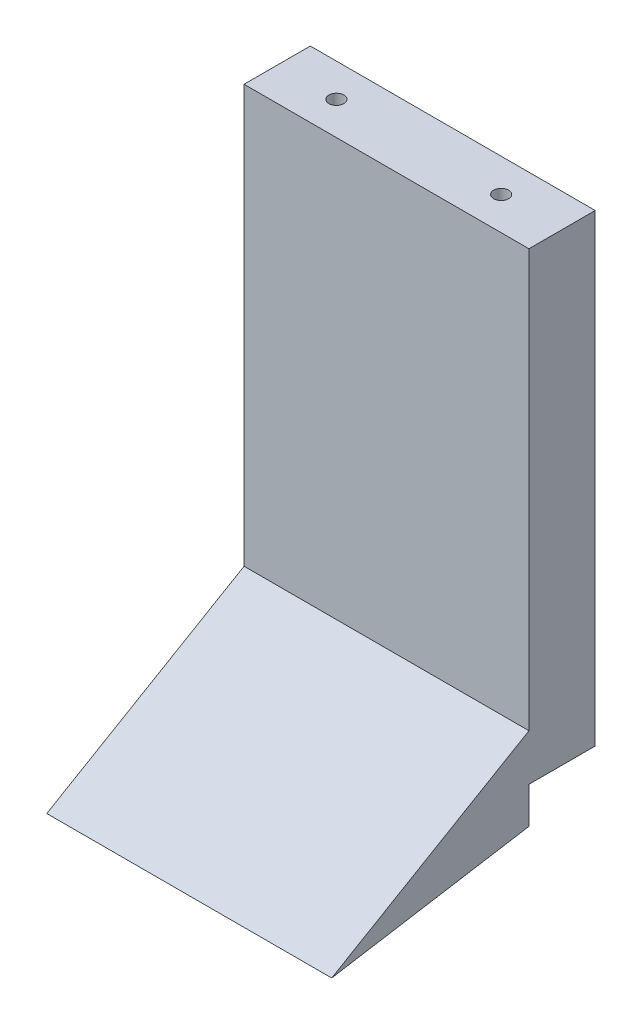
ISO-10303-21;
HEADER;
FILE_DESCRIPTION(('STEP AP214'),'2;1');
FILE_NAME('part.step','',(''),(''),'','','');
FILE_SCHEMA(('AUTOMOTIVE_DESIGN { 1 0 10303 214 1 1 1 1 }'));
ENDSEC;
DATA;
#1=APPLICATION_CONTEXT('core data for automotive mechanical design processes');
#2=APPLICATION_PROTOCOL_DEFINITION('international standard','automotive_design',2000,#1);
#3=PRODUCT_CONTEXT('',#1,'mechanical');
#4=PRODUCT('Part','Part','',(#3));
#5=PRODUCT_RELATED_PRODUCT_CATEGORY('part','',(#4));
#6=PRODUCT_DEFINITION_FORMATION('','',#4);
#7=PRODUCT_DEFINITION_CONTEXT('part definition',#1,'design');
#8=PRODUCT_DEFINITION('design','',#6,#7);
#9=PRODUCT_DEFINITION_SHAPE('','',#8);
#10=(LENGTH_UNIT() NAMED_UNIT(*) SI_UNIT(.MILLI.,.METRE.));
#11=(NAMED_UNIT(*) PLANE_ANGLE_UNIT() SI_UNIT($,.RADIAN.));
#12=(NAMED_UNIT(*) SI_UNIT($,.STERADIAN.) SOLID_ANGLE_UNIT());
#13=UNCERTAINTY_MEASURE_WITH_UNIT(LENGTH_MEASURE(1.E-05),#10,'distance_accuracy_value','');
#14=(GEOMETRIC_REPRESENTATION_CONTEXT(3) GLOBAL_UNCERTAINTY_ASSIGNED_CONTEXT((#13)) GLOBAL_UNIT_ASSIGNED_CONTEXT((#10,
#11,#12)) REPRESENTATION_CONTEXT('',''));
#15=CARTESIAN_POINT('',(0.,0.,0.));
#16=DIRECTION('',(0.,0.,1.));
#17=DIRECTION('',(1.,0.,0.));
#18=AXIS2_PLACEMENT_3D('',#15,#16,#17);
#19=CARTESIAN_POINT('',(-21.5,70.,-5.));
#20=DIRECTION('',(1.,0.,0.));
#21=DIRECTION('',(0.,0.,-1.));
#22=AXIS2_PLACEMENT_3D('',#19,#20,#21);
#23=PLANE('',#22);
#24=DIRECTION('',(0.,0.,1.));
#25=VECTOR('',#24,1.);
#26=CARTESIAN_POINT('',(-21.5,0.,-5.));
#27=LINE('',#26,#25);
#28=CARTESIAN_POINT('',(-21.5,0.,-5.));
#29=VERTEX_POINT('',#28);
#30=CARTESIAN_POINT('',(-21.5,0.,5.));
#31=VERTEX_POINT('',#30);
#32=EDGE_CURVE('E144',#29,#31,#27,.T.);
#33=ORIENTED_EDGE('',*,*,#32,.T.);
#34=DIRECTION('',(0.,1.,0.));
#35=VECTOR('',#34,1.);
#36=CARTESIAN_POINT('',(-21.5,7.,5.));
#37=LINE('',#36,#35);
#38=CARTESIAN_POINT('',(-21.5,-5.5,4.99999999999999));
#39=VERTEX_POINT('',#38);
#40=EDGE_CURVE('E145',#39,#31,#37,.T.);
#41=ORIENTED_EDGE('',*,*,#40,.F.);
#42=DIRECTION('',(0.,-0.163397190022268,0.986560367282624));
#43=VECTOR('',#42,1.);
#44=CARTESIAN_POINT('',(-21.5,-10.431034139205,34.7726224716243));
#45=LINE('',#44,#43);
#46=CARTESIAN_POINT('',(-21.5,-10.431034139205,34.7726224716243));
#47=VERTEX_POINT('',#46);
#48=EDGE_CURVE('E129',#39,#47,#45,.T.);
#49=ORIENTED_EDGE('',*,*,#48,.T.);
#50=DIRECTION('',(0.,0.505247366353768,-0.862974564394908));
#51=VECTOR('',#50,1.);
#52=CARTESIAN_POINT('',(-21.5,7.,5.));
#53=LINE('',#52,#51);
#54=CARTESIAN_POINT('',(-21.5,7.,5.));
#55=VERTEX_POINT('',#54);
#56=EDGE_CURVE('E142',#47,#55,#53,.T.);
#57=ORIENTED_EDGE('',*,*,#56,.T.);
#58=DIRECTION('',(0.,-1.,0.));
#59=VECTOR('',#58,1.);
#60=CARTESIAN_POINT('',(-21.5,70.,5.));
#61=LINE('',#60,#59);
#62=CARTESIAN_POINT('',(-21.5,70.,5.));
#63=VERTEX_POINT('',#62);
#64=EDGE_CURVE('E11',#63,#55,#61,.T.);
#65=ORIENTED_EDGE('',*,*,#64,.F.);
#66=DIRECTION('',(0.,0.,1.));
#67=VECTOR('',#66,1.);
#68=CARTESIAN_POINT('',(-21.5,70.,-5.));
#69=LINE('',#68,#67);
#70=CARTESIAN_POINT('',(-21.5,70.,-5.));
#71=VERTEX_POINT('',#70);
#72=EDGE_CURVE('E146',#71,#63,#69,.T.);
#73=ORIENTED_EDGE('',*,*,#72,.F.);
#74=DIRECTION('',(0.,-1.,0.));
#75=VECTOR('',#74,1.);
#76=CARTESIAN_POINT('',(-21.5,70.,-5.));
#77=LINE('',#76,#75);
#78=EDGE_CURVE('E152',#71,#29,#77,.T.);
#79=ORIENTED_EDGE('',*,*,#78,.T.);
#80=EDGE_LOOP('',(#33,#41,#49,#57,#65,#73,#79));
#81=FACE_BOUND('',#80,.T.);
#82=ADVANCED_FACE('F41',(#81),#23,.F.);
#83=CARTESIAN_POINT('',(-21.5,70.,5.));
#84=DIRECTION('',(0.,0.,-1.));
#85=DIRECTION('',(-1.,0.,0.));
#86=AXIS2_PLACEMENT_3D('',#83,#84,#85);
#87=PLANE('',#86);
#88=ORIENTED_EDGE('',*,*,#64,.T.);
#89=DIRECTION('',(1.,0.,0.));
#90=VECTOR('',#89,1.);
#91=CARTESIAN_POINT('',(-56.,7.,5.));
#92=LINE('',#91,#90);
#93=CARTESIAN_POINT('',(21.5,7.00000000000001,5.));
#94=VERTEX_POINT('',#93);
#95=EDGE_CURVE('E135',#55,#94,#92,.T.);
#96=ORIENTED_EDGE('',*,*,#95,.T.);
#97=DIRECTION('',(0.,-1.,0.));
#98=VECTOR('',#97,1.);
#99=CARTESIAN_POINT('',(21.5,70.,5.));
#100=LINE('',#99,#98);
#101=CARTESIAN_POINT('',(21.5,70.,5.));
#102=VERTEX_POINT('',#101);
#103=EDGE_CURVE('E50',#102,#94,#100,.T.);
#104=ORIENTED_EDGE('',*,*,#103,.F.);
#105=DIRECTION('',(1.,0.,0.));
#106=VECTOR('',#105,1.);
#107=CARTESIAN_POINT('',(-21.5,70.,5.));
#108=LINE('',#107,#106);
#109=EDGE_CURVE('E89',#63,#102,#108,.T.);
#110=ORIENTED_EDGE('',*,*,#109,.F.);
#111=EDGE_LOOP('',(#88,#96,#104,#110));
#112=FACE_BOUND('',#111,.T.);
#113=ADVANCED_FACE('F220',(#112),#87,.F.);
#114=CARTESIAN_POINT('',(21.5,70.,-5.));
#115=DIRECTION('',(-1.,0.,0.));
#116=DIRECTION('',(0.,0.,1.));
#117=AXIS2_PLACEMENT_3D('',#114,#115,#116);
#118=PLANE('',#117);
#119=DIRECTION('',(0.,0.,-1.));
#120=VECTOR('',#119,1.);
#121=CARTESIAN_POINT('',(21.5,0.,-5.));
#122=LINE('',#121,#120);
#123=CARTESIAN_POINT('',(21.5,0.,5.));
#124=VERTEX_POINT('',#123);
#125=CARTESIAN_POINT('',(21.5,0.,-5.));
#126=VERTEX_POINT('',#125);
#127=EDGE_CURVE('E157',#124,#126,#122,.T.);
#128=ORIENTED_EDGE('',*,*,#127,.T.);
#129=DIRECTION('',(0.,-1.,0.));
#130=VECTOR('',#129,1.);
#131=CARTESIAN_POINT('',(21.5,70.,-5.));
#132=LINE('',#131,#130);
#133=CARTESIAN_POINT('',(21.5,70.,-5.));
#134=VERTEX_POINT('',#133);
#135=EDGE_CURVE('E161',#134,#126,#132,.T.);
#136=ORIENTED_EDGE('',*,*,#135,.F.);
#137=DIRECTION('',(0.,0.,-1.));
#138=VECTOR('',#137,1.);
#139=CARTESIAN_POINT('',(21.5,70.,-5.));
#140=LINE('',#139,#138);
#141=EDGE_CURVE('E149',#102,#134,#140,.T.);
#142=ORIENTED_EDGE('',*,*,#141,.F.);
#143=ORIENTED_EDGE('',*,*,#103,.T.);
#144=DIRECTION('',(0.,-0.505247366353768,0.862974564394908));
#145=VECTOR('',#144,1.);
#146=CARTESIAN_POINT('',(21.5,7.,5.));
#147=LINE('',#146,#145);
#148=CARTESIAN_POINT('',(21.5,-10.431034139205,34.7726224716243));
#149=VERTEX_POINT('',#148);
#150=EDGE_CURVE('E58',#94,#149,#147,.T.);
#151=ORIENTED_EDGE('',*,*,#150,.T.);
#152=DIRECTION('',(0.,0.163397190022268,-0.986560367282624));
#153=VECTOR('',#152,1.);
#154=CARTESIAN_POINT('',(21.5,-10.431034139205,34.7726224716243));
#155=LINE('',#154,#153);
#156=CARTESIAN_POINT('',(21.5,-5.5,5.));
#157=VERTEX_POINT('',#156);
#158=EDGE_CURVE('E121',#149,#157,#155,.T.);
#159=ORIENTED_EDGE('',*,*,#158,.T.);
#160=DIRECTION('',(0.,-1.,0.));
#161=VECTOR('',#160,1.);
#162=CARTESIAN_POINT('',(21.5,7.,5.));
#163=LINE('',#162,#161);
#164=EDGE_CURVE('E112',#124,#157,#163,.T.);
#165=ORIENTED_EDGE('',*,*,#164,.F.);
#166=EDGE_LOOP('',(#128,#136,#142,#143,#151,#159,#165));
#167=FACE_BOUND('',#166,.T.);
#168=ADVANCED_FACE('F132',(#167),#118,.F.);
#169=CARTESIAN_POINT('',(-21.5,70.,-5.));
#170=DIRECTION('',(0.,0.,1.));
#171=DIRECTION('',(1.,0.,0.));
#172=AXIS2_PLACEMENT_3D('',#169,#170,#171);
#173=PLANE('',#172);
#174=DIRECTION('',(-1.,0.,0.));
#175=VECTOR('',#174,1.);
#176=CARTESIAN_POINT('',(-21.5,0.,-5.));
#177=LINE('',#176,#175);
#178=EDGE_CURVE('E82',#126,#29,#177,.T.);
#179=ORIENTED_EDGE('',*,*,#178,.T.);
#180=ORIENTED_EDGE('',*,*,#78,.F.);
#181=DIRECTION('',(-1.,0.,0.));
#182=VECTOR('',#181,1.);
#183=CARTESIAN_POINT('',(-21.5,70.,-5.));
#184=LINE('',#183,#182);
#185=EDGE_CURVE('E67',#134,#71,#184,.T.);
#186=ORIENTED_EDGE('',*,*,#185,.F.);
#187=ORIENTED_EDGE('',*,*,#135,.T.);
#188=EDGE_LOOP('',(#179,#180,#186,#187));
#189=FACE_BOUND('',#188,.T.);
#190=ADVANCED_FACE('F216',(#189),#173,.F.);
#191=CARTESIAN_POINT('',(0.,70.,0.));
#192=DIRECTION('',(0.,1.,0.));
#193=DIRECTION('',(0.,0.,1.));
#194=AXIS2_PLACEMENT_3D('',#191,#192,#193);
#195=PLANE('',#194);
#196=CARTESIAN_POINT('',(12.305,70.,0.));
#197=DIRECTION('',(0.,1.,0.));
#198=DIRECTION('',(0.,0.,1.));
#199=AXIS2_PLACEMENT_3D('',#196,#197,#198);
#200=CIRCLE('',#199,1.13029999999999);
#201=CARTESIAN_POINT('',(12.305,70.,1.13029999999999));
#202=VERTEX_POINT('',#201);
#203=EDGE_CURVE('E176',#202,#202,#200,.T.);
#204=ORIENTED_EDGE('',*,*,#203,.F.);
#205=EDGE_LOOP('',(#204));
#206=FACE_BOUND('',#205,.T.);
#207=CARTESIAN_POINT('',(-12.565,70.,0.));
#208=DIRECTION('',(0.,1.,0.));
#209=DIRECTION('',(0.,0.,1.));
#210=AXIS2_PLACEMENT_3D('',#207,#208,#209);
#211=CIRCLE('',#210,1.13029999999999);
#212=CARTESIAN_POINT('',(-12.565,70.,1.13029999999999));
#213=VERTEX_POINT('',#212);
#214=EDGE_CURVE('E171',#213,#213,#211,.T.);
#215=ORIENTED_EDGE('',*,*,#214,.F.);
#216=EDGE_LOOP('',(#215));
#217=FACE_BOUND('',#216,.T.);
#218=ORIENTED_EDGE('',*,*,#72,.T.);
#219=ORIENTED_EDGE('',*,*,#109,.T.);
#220=ORIENTED_EDGE('',*,*,#141,.T.);
#221=ORIENTED_EDGE('',*,*,#185,.T.);
#222=EDGE_LOOP('',(#218,#219,#220,#221));
#223=FACE_BOUND('',#222,.T.);
#224=ADVANCED_FACE('F219',(#206,#217,#223),#195,.T.);
#225=CARTESIAN_POINT('',(0.,0.,0.));
#226=DIRECTION('',(0.,1.,0.));
#227=DIRECTION('',(0.,0.,1.));
#228=AXIS2_PLACEMENT_3D('',#225,#226,#227);
#229=PLANE('',#228);
#230=CARTESIAN_POINT('',(12.355,0.,0.));
#231=DIRECTION('',(0.,-1.,0.));
#232=DIRECTION('',(0.,0.,-1.));
#233=AXIS2_PLACEMENT_3D('',#230,#231,#232);
#234=CIRCLE('',#233,1.13029999999999);
#235=CARTESIAN_POINT('',(12.355,0.,-1.13029999999999));
#236=VERTEX_POINT('',#235);
#237=EDGE_CURVE('E435',#236,#236,#234,.T.);
#238=ORIENTED_EDGE('',*,*,#237,.F.);
#239=EDGE_LOOP('',(#238));
#240=FACE_BOUND('',#239,.T.);
#241=CARTESIAN_POINT('',(-12.515,0.,0.));
#242=DIRECTION('',(0.,-1.,0.));
#243=DIRECTION('',(0.,0.,-1.));
#244=AXIS2_PLACEMENT_3D('',#241,#242,#243);
#245=CIRCLE('',#244,1.13029999999999);
#246=CARTESIAN_POINT('',(-12.515,0.,-1.13029999999999));
#247=VERTEX_POINT('',#246);
#248=EDGE_CURVE('E185',#247,#247,#245,.T.);
#249=ORIENTED_EDGE('',*,*,#248,.F.);
#250=EDGE_LOOP('',(#249));
#251=FACE_BOUND('',#250,.T.);
#252=ORIENTED_EDGE('',*,*,#32,.F.);
#253=ORIENTED_EDGE('',*,*,#178,.F.);
#254=ORIENTED_EDGE('',*,*,#127,.F.);
#255=DIRECTION('',(1.,0.,0.));
#256=VECTOR('',#255,1.);
#257=CARTESIAN_POINT('',(-21.5,0.,5.));
#258=LINE('',#257,#256);
#259=EDGE_CURVE('E117',#31,#124,#258,.T.);
#260=ORIENTED_EDGE('',*,*,#259,.F.);
#261=EDGE_LOOP('',(#252,#253,#254,#260));
#262=FACE_BOUND('',#261,.T.);
#263=ADVANCED_FACE('F213',(#240,#251,#262),#229,.F.);
#264=CARTESIAN_POINT('',(-56.,7.,5.));
#265=DIRECTION('',(0.,0.,1.));
#266=DIRECTION('',(0.,-1.,0.));
#267=AXIS2_PLACEMENT_3D('',#264,#265,#266);
#268=PLANE('',#267);
#269=ORIENTED_EDGE('',*,*,#40,.T.);
#270=ORIENTED_EDGE('',*,*,#259,.T.);
#271=ORIENTED_EDGE('',*,*,#164,.T.);
#272=DIRECTION('',(1.,0.,0.));
#273=VECTOR('',#272,1.);
#274=CARTESIAN_POINT('',(-56.,-5.5,5.));
#275=LINE('',#274,#273);
#276=EDGE_CURVE('E115',#39,#157,#275,.T.);
#277=ORIENTED_EDGE('',*,*,#276,.F.);
#278=EDGE_LOOP('',(#269,#270,#271,#277));
#279=FACE_BOUND('',#278,.T.);
#280=ADVANCED_FACE('F114',(#279),#268,.F.);
#281=CARTESIAN_POINT('',(-56.,-10.431034139205,34.7726224716243));
#282=DIRECTION('',(0.,-0.986560367282625,-0.163397190022268));
#283=DIRECTION('',(0.,0.163397190022268,-0.986560367282624));
#284=AXIS2_PLACEMENT_3D('',#281,#282,#283);
#285=PLANE('',#284);
#286=ORIENTED_EDGE('',*,*,#48,.F.);
#287=ORIENTED_EDGE('',*,*,#276,.T.);
#288=ORIENTED_EDGE('',*,*,#158,.F.);
#289=DIRECTION('',(1.,0.,0.));
#290=VECTOR('',#289,1.);
#291=CARTESIAN_POINT('',(-56.,-10.431034139205,34.7726224716243));
#292=LINE('',#291,#290);
#293=EDGE_CURVE('E130',#47,#149,#292,.T.);
#294=ORIENTED_EDGE('',*,*,#293,.F.);
#295=EDGE_LOOP('',(#286,#287,#288,#294));
#296=FACE_BOUND('',#295,.T.);
#297=ADVANCED_FACE('F127',(#296),#285,.T.);
#298=CARTESIAN_POINT('',(-56.,7.,5.));
#299=DIRECTION('',(0.,0.862974564394908,0.505247366353768));
#300=DIRECTION('',(0.,-0.505247366353768,0.862974564394908));
#301=AXIS2_PLACEMENT_3D('',#298,#299,#300);
#302=PLANE('',#301);
#303=ORIENTED_EDGE('',*,*,#56,.F.);
#304=ORIENTED_EDGE('',*,*,#293,.T.);
#305=ORIENTED_EDGE('',*,*,#150,.F.);
#306=ORIENTED_EDGE('',*,*,#95,.F.);
#307=EDGE_LOOP('',(#303,#304,#305,#306));
#308=FACE_BOUND('',#307,.T.);
#309=ADVANCED_FACE('F222',(#308),#302,.T.);
#310=CARTESIAN_POINT('',(-12.565,62.4,0.));
#311=DIRECTION('',(0.,1.,0.));
#312=DIRECTION('',(0.,0.,1.));
#313=AXIS2_PLACEMENT_3D('',#310,#311,#312);
#314=CONICAL_SURFACE('',#313,1.13029999999999,1.02974425867665);
#315=CARTESIAN_POINT('',(-12.565,62.4,0.));
#316=DIRECTION('',(0.,1.,0.));
#317=DIRECTION('',(0.,0.,1.));
#318=AXIS2_PLACEMENT_3D('',#315,#316,#317);
#319=CIRCLE('',#318,1.13029999999999);
#320=CARTESIAN_POINT('',(-12.565,62.4,1.13029999999999));
#321=VERTEX_POINT('',#320);
#322=EDGE_CURVE('E168',#321,#321,#319,.T.);
#323=ORIENTED_EDGE('',*,*,#322,.T.);
#324=EDGE_LOOP('',(#323));
#325=FACE_BOUND('',#324,.T.);
#326=CARTESIAN_POINT('',(-12.565,62.132436766347,0.));
#327=DIRECTION('',(0.,1.,0.));
#328=DIRECTION('',(0.,0.,1.));
#329=AXIS2_PLACEMENT_3D('',#326,#327,#328);
#330=CIRCLE('',#329,0.684999999999999);
#331=CARTESIAN_POINT('',(-12.565,62.132436766347,0.684999999999999));
#332=VERTEX_POINT('',#331);
#333=EDGE_CURVE('E164',#332,#332,#330,.T.);
#334=ORIENTED_EDGE('',*,*,#333,.F.);
#335=EDGE_LOOP('',(#334));
#336=FACE_BOUND('',#335,.T.);
#337=ADVANCED_FACE('F224',(#325,#336),#314,.F.);
#338=CARTESIAN_POINT('',(-12.565,70.,0.));
#339=DIRECTION('',(0.,1.,0.));
#340=DIRECTION('',(0.,0.,1.));
#341=AXIS2_PLACEMENT_3D('',#338,#339,#340);
#342=CYLINDRICAL_SURFACE('',#341,1.13029999999999);
#343=ORIENTED_EDGE('',*,*,#322,.F.);
#344=EDGE_LOOP('',(#343));
#345=FACE_BOUND('',#344,.T.);
#346=ORIENTED_EDGE('',*,*,#214,.T.);
#347=EDGE_LOOP('',(#346));
#348=FACE_BOUND('',#347,.T.);
#349=ADVANCED_FACE('F229',(#345,#348),#342,.F.);
#350=CARTESIAN_POINT('',(-12.565,55.,0.));
#351=DIRECTION('',(0.,1.,0.));
#352=DIRECTION('',(0.,0.,1.));
#353=AXIS2_PLACEMENT_3D('',#350,#351,#352);
#354=PLANE('',#353);
#355=CARTESIAN_POINT('',(-12.565,55.,0.));
#356=DIRECTION('',(0.,1.,0.));
#357=DIRECTION('',(0.,0.,1.));
#358=AXIS2_PLACEMENT_3D('',#355,#356,#357);
#359=CIRCLE('',#358,0.684999999999999);
#360=CARTESIAN_POINT('',(-12.565,55.,0.684999999999999));
#361=VERTEX_POINT('',#360);
#362=EDGE_CURVE('E200',#361,#361,#359,.T.);
#363=ORIENTED_EDGE('',*,*,#362,.T.);
#364=EDGE_LOOP('',(#363));
#365=FACE_BOUND('',#364,.T.);
#366=ADVANCED_FACE('F338',(#365),#354,.T.);
#367=CARTESIAN_POINT('',(-12.565,55.,0.));
#368=DIRECTION('',(0.,1.,0.));
#369=DIRECTION('',(0.,0.,1.));
#370=AXIS2_PLACEMENT_3D('',#367,#368,#369);
#371=CYLINDRICAL_SURFACE('',#370,0.684999999999999);
#372=ORIENTED_EDGE('',*,*,#333,.T.);
#373=EDGE_LOOP('',(#372));
#374=FACE_BOUND('',#373,.T.);
#375=ORIENTED_EDGE('',*,*,#362,.F.);
#376=EDGE_LOOP('',(#375));
#377=FACE_BOUND('',#376,.T.);
#378=ADVANCED_FACE('F332',(#374,#377),#371,.F.);
#379=CARTESIAN_POINT('',(12.305,62.4,0.));
#380=DIRECTION('',(0.,1.,0.));
#381=DIRECTION('',(0.,0.,1.));
#382=AXIS2_PLACEMENT_3D('',#379,#380,#381);
#383=CONICAL_SURFACE('',#382,1.13029999999999,1.02974425867665);
#384=CARTESIAN_POINT('',(12.305,62.4,0.));
#385=DIRECTION('',(0.,1.,0.));
#386=DIRECTION('',(0.,0.,1.));
#387=AXIS2_PLACEMENT_3D('',#384,#385,#386);
#388=CIRCLE('',#387,1.13029999999999);
#389=CARTESIAN_POINT('',(12.305,62.4,1.13029999999999));
#390=VERTEX_POINT('',#389);
#391=EDGE_CURVE('E172',#390,#390,#388,.T.);
#392=ORIENTED_EDGE('',*,*,#391,.T.);
#393=EDGE_LOOP('',(#392));
#394=FACE_BOUND('',#393,.T.);
#395=CARTESIAN_POINT('',(12.305,62.132436766347,0.));
#396=DIRECTION('',(0.,1.,0.));
#397=DIRECTION('',(0.,0.,1.));
#398=AXIS2_PLACEMENT_3D('',#395,#396,#397);
#399=CIRCLE('',#398,0.684999999999999);
#400=CARTESIAN_POINT('',(12.305,62.132436766347,0.684999999999999));
#401=VERTEX_POINT('',#400);
#402=EDGE_CURVE('E169',#401,#401,#399,.T.);
#403=ORIENTED_EDGE('',*,*,#402,.F.);
#404=EDGE_LOOP('',(#403));
#405=FACE_BOUND('',#404,.T.);
#406=ADVANCED_FACE('F337',(#394,#405),#383,.F.);
#407=CARTESIAN_POINT('',(12.305,70.,0.));
#408=DIRECTION('',(0.,1.,0.));
#409=DIRECTION('',(0.,0.,1.));
#410=AXIS2_PLACEMENT_3D('',#407,#408,#409);
#411=CYLINDRICAL_SURFACE('',#410,1.13029999999999);
#412=ORIENTED_EDGE('',*,*,#391,.F.);
#413=EDGE_LOOP('',(#412));
#414=FACE_BOUND('',#413,.T.);
#415=ORIENTED_EDGE('',*,*,#203,.T.);
#416=EDGE_LOOP('',(#415));
#417=FACE_BOUND('',#416,.T.);
#418=ADVANCED_FACE('F327',(#414,#417),#411,.F.);
#419=CARTESIAN_POINT('',(12.305,55.,0.));
#420=DIRECTION('',(0.,1.,0.));
#421=DIRECTION('',(0.,0.,1.));
#422=AXIS2_PLACEMENT_3D('',#419,#420,#421);
#423=PLANE('',#422);
#424=CARTESIAN_POINT('',(12.305,55.,0.));
#425=DIRECTION('',(0.,1.,0.));
#426=DIRECTION('',(0.,0.,1.));
#427=AXIS2_PLACEMENT_3D('',#424,#425,#426);
#428=CIRCLE('',#427,0.684999999999999);
#429=CARTESIAN_POINT('',(12.305,55.,0.684999999999999));
#430=VERTEX_POINT('',#429);
#431=EDGE_CURVE('E167',#430,#430,#428,.T.);
#432=ORIENTED_EDGE('',*,*,#431,.T.);
#433=EDGE_LOOP('',(#432));
#434=FACE_BOUND('',#433,.T.);
#435=ADVANCED_FACE('F317',(#434),#423,.T.);
#436=CARTESIAN_POINT('',(12.305,55.,0.));
#437=DIRECTION('',(0.,1.,0.));
#438=DIRECTION('',(0.,0.,1.));
#439=AXIS2_PLACEMENT_3D('',#436,#437,#438);
#440=CYLINDRICAL_SURFACE('',#439,0.684999999999999);
#441=ORIENTED_EDGE('',*,*,#402,.T.);
#442=EDGE_LOOP('',(#441));
#443=FACE_BOUND('',#442,.T.);
#444=ORIENTED_EDGE('',*,*,#431,.F.);
#445=EDGE_LOOP('',(#444));
#446=FACE_BOUND('',#445,.T.);
#447=ADVANCED_FACE('F311',(#443,#446),#440,.F.);
#448=CARTESIAN_POINT('',(-12.515,7.6,0.));
#449=DIRECTION('',(0.,-1.,0.));
#450=DIRECTION('',(0.,0.,-1.));
#451=AXIS2_PLACEMENT_3D('',#448,#449,#450);
#452=CONICAL_SURFACE('',#451,1.13029999999999,1.02974425867665);
#453=CARTESIAN_POINT('',(-12.515,7.6,0.));
#454=DIRECTION('',(0.,-1.,0.));
#455=DIRECTION('',(0.,0.,-1.));
#456=AXIS2_PLACEMENT_3D('',#453,#454,#455);
#457=CIRCLE('',#456,1.13029999999999);
#458=CARTESIAN_POINT('',(-12.515,7.6,-1.13029999999999));
#459=VERTEX_POINT('',#458);
#460=EDGE_CURVE('E177',#459,#459,#457,.T.);
#461=ORIENTED_EDGE('',*,*,#460,.T.);
#462=EDGE_LOOP('',(#461));
#463=FACE_BOUND('',#462,.T.);
#464=CARTESIAN_POINT('',(-12.515,7.86756323365296,0.));
#465=DIRECTION('',(0.,-1.,0.));
#466=DIRECTION('',(0.,0.,-1.));
#467=AXIS2_PLACEMENT_3D('',#464,#465,#466);
#468=CIRCLE('',#467,0.684999999999999);
#469=CARTESIAN_POINT('',(-12.515,7.86756323365296,-0.684999999999999));
#470=VERTEX_POINT('',#469);
#471=EDGE_CURVE('E173',#470,#470,#468,.T.);
#472=ORIENTED_EDGE('',*,*,#471,.F.);
#473=EDGE_LOOP('',(#472));
#474=FACE_BOUND('',#473,.T.);
#475=ADVANCED_FACE('F316',(#463,#474),#452,.F.);
#476=CARTESIAN_POINT('',(-12.515,0.,0.));
#477=DIRECTION('',(0.,-1.,0.));
#478=DIRECTION('',(0.,0.,-1.));
#479=AXIS2_PLACEMENT_3D('',#476,#477,#478);
#480=CYLINDRICAL_SURFACE('',#479,1.13029999999999);
#481=ORIENTED_EDGE('',*,*,#460,.F.);
#482=EDGE_LOOP('',(#481));
#483=FACE_BOUND('',#482,.T.);
#484=ORIENTED_EDGE('',*,*,#248,.T.);
#485=EDGE_LOOP('',(#484));
#486=FACE_BOUND('',#485,.T.);
#487=ADVANCED_FACE('F306',(#483,#486),#480,.F.);
#488=CARTESIAN_POINT('',(-12.515,15.,0.));
#489=DIRECTION('',(0.,-1.,0.));
#490=DIRECTION('',(0.,0.,-1.));
#491=AXIS2_PLACEMENT_3D('',#488,#489,#490);
#492=PLANE('',#491);
#493=CARTESIAN_POINT('',(-12.515,15.,0.));
#494=DIRECTION('',(0.,-1.,0.));
#495=DIRECTION('',(0.,0.,-1.));
#496=AXIS2_PLACEMENT_3D('',#493,#494,#495);
#497=CIRCLE('',#496,0.684999999999999);
#498=CARTESIAN_POINT('',(-12.515,15.,-0.684999999999999));
#499=VERTEX_POINT('',#498);
#500=EDGE_CURVE('E122',#499,#499,#497,.T.);
#501=ORIENTED_EDGE('',*,*,#500,.T.);
#502=EDGE_LOOP('',(#501));
#503=FACE_BOUND('',#502,.T.);
#504=ADVANCED_FACE('F296',(#503),#492,.T.);
#505=CARTESIAN_POINT('',(-12.515,15.,0.));
#506=DIRECTION('',(0.,-1.,0.));
#507=DIRECTION('',(0.,0.,-1.));
#508=AXIS2_PLACEMENT_3D('',#505,#506,#507);
#509=CYLINDRICAL_SURFACE('',#508,0.684999999999999);
#510=ORIENTED_EDGE('',*,*,#471,.T.);
#511=EDGE_LOOP('',(#510));
#512=FACE_BOUND('',#511,.T.);
#513=ORIENTED_EDGE('',*,*,#500,.F.);
#514=EDGE_LOOP('',(#513));
#515=FACE_BOUND('',#514,.T.);
#516=ADVANCED_FACE('F290',(#512,#515),#509,.F.);
#517=CARTESIAN_POINT('',(12.355,7.6,0.));
#518=DIRECTION('',(0.,-1.,0.));
#519=DIRECTION('',(0.,0.,-1.));
#520=AXIS2_PLACEMENT_3D('',#517,#518,#519);
#521=CONICAL_SURFACE('',#520,1.13029999999999,1.02974425867665);
#522=CARTESIAN_POINT('',(12.355,7.6,0.));
#523=DIRECTION('',(0.,-1.,0.));
#524=DIRECTION('',(0.,0.,-1.));
#525=AXIS2_PLACEMENT_3D('',#522,#523,#524);
#526=CIRCLE('',#525,1.13029999999999);
#527=CARTESIAN_POINT('',(12.355,7.6,-1.13029999999999));
#528=VERTEX_POINT('',#527);
#529=EDGE_CURVE('E432',#528,#528,#526,.T.);
#530=ORIENTED_EDGE('',*,*,#529,.T.);
#531=EDGE_LOOP('',(#530));
#532=FACE_BOUND('',#531,.T.);
#533=CARTESIAN_POINT('',(12.355,7.86756323365296,0.));
#534=DIRECTION('',(0.,-1.,0.));
#535=DIRECTION('',(0.,0.,-1.));
#536=AXIS2_PLACEMENT_3D('',#533,#534,#535);
#537=CIRCLE('',#536,0.684999999999999);
#538=CARTESIAN_POINT('',(12.355,7.86756323365296,-0.684999999999999));
#539=VERTEX_POINT('',#538);
#540=EDGE_CURVE('E44',#539,#539,#537,.T.);
#541=ORIENTED_EDGE('',*,*,#540,.F.);
#542=EDGE_LOOP('',(#541));
#543=FACE_BOUND('',#542,.T.);
#544=ADVANCED_FACE('F295',(#532,#543),#521,.F.);
#545=CARTESIAN_POINT('',(12.355,0.,0.));
#546=DIRECTION('',(0.,-1.,0.));
#547=DIRECTION('',(0.,0.,-1.));
#548=AXIS2_PLACEMENT_3D('',#545,#546,#547);
#549=CYLINDRICAL_SURFACE('',#548,1.13029999999999);
#550=ORIENTED_EDGE('',*,*,#529,.F.);
#551=EDGE_LOOP('',(#550));
#552=FACE_BOUND('',#551,.T.);
#553=ORIENTED_EDGE('',*,*,#237,.T.);
#554=EDGE_LOOP('',(#553));
#555=FACE_BOUND('',#554,.T.);
#556=ADVANCED_FACE('F285',(#552,#555),#549,.F.);
#557=CARTESIAN_POINT('',(12.355,15.,0.));
#558=DIRECTION('',(0.,-1.,0.));
#559=DIRECTION('',(0.,0.,-1.));
#560=AXIS2_PLACEMENT_3D('',#557,#558,#559);
#561=PLANE('',#560);
#562=CARTESIAN_POINT('',(12.355,15.,0.));
#563=DIRECTION('',(0.,-1.,0.));
#564=DIRECTION('',(0.,0.,-1.));
#565=AXIS2_PLACEMENT_3D('',#562,#563,#564);
#566=CIRCLE('',#565,0.684999999999999);
#567=CARTESIAN_POINT('',(12.355,15.,-0.684999999999999));
#568=VERTEX_POINT('',#567);
#569=EDGE_CURVE('E203',#568,#568,#566,.T.);
#570=ORIENTED_EDGE('',*,*,#569,.T.);
#571=EDGE_LOOP('',(#570));
#572=FACE_BOUND('',#571,.T.);
#573=ADVANCED_FACE('F276',(#572),#561,.T.);
#574=CARTESIAN_POINT('',(12.355,15.,0.));
#575=DIRECTION('',(0.,-1.,0.));
#576=DIRECTION('',(0.,0.,-1.));
#577=AXIS2_PLACEMENT_3D('',#574,#575,#576);
#578=CYLINDRICAL_SURFACE('',#577,0.684999999999999);
#579=ORIENTED_EDGE('',*,*,#540,.T.);
#580=EDGE_LOOP('',(#579));
#581=FACE_BOUND('',#580,.T.);
#582=ORIENTED_EDGE('',*,*,#569,.F.);
#583=EDGE_LOOP('',(#582));
#584=FACE_BOUND('',#583,.T.);
#585=ADVANCED_FACE('F271',(#581,#584),#578,.F.);
#586=CLOSED_SHELL('',(#82,#113,#168,#190,#224,#263,#280,#297,#309,#337,#349,#366,#378,#406,#418,
#435,#447,#475,#487,#504,#516,#544,#556,#573,#585));
#587=MANIFOLD_SOLID_BREP('B2',#586);
#588=ADVANCED_BREP_SHAPE_REPRESENTATION('',(#18,#587),#14);
#589=SHAPE_DEFINITION_REPRESENTATION(#9,#588);
ENDSEC;
END-ISO-10303-21;
